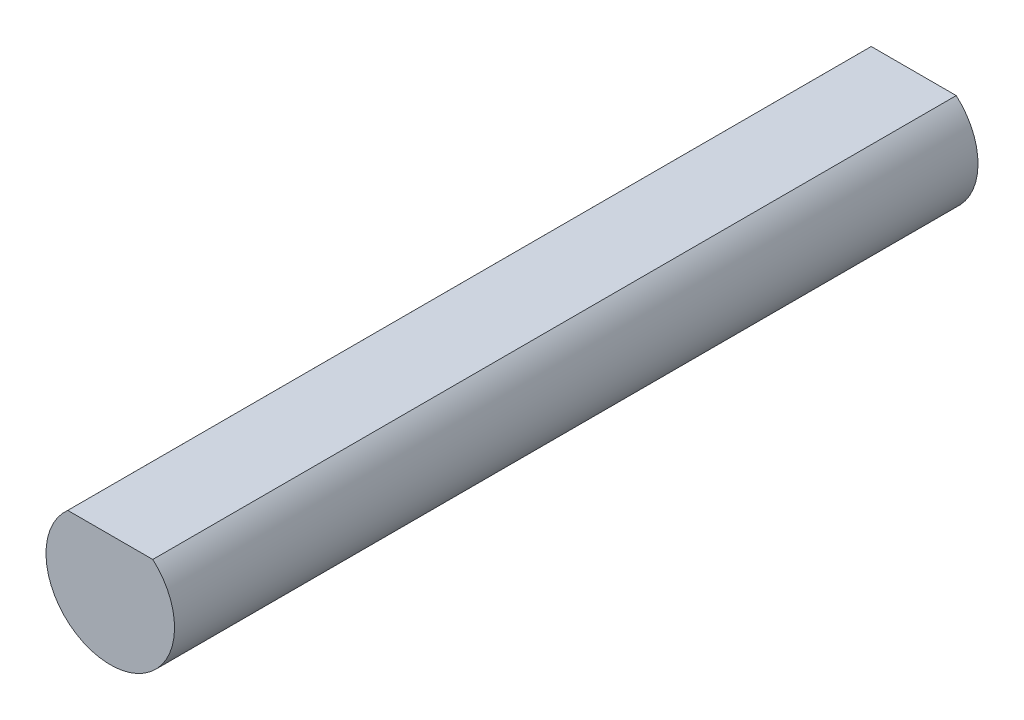
ISO-10303-21;
HEADER;
FILE_DESCRIPTION(('STEP AP214'),'2;1');
FILE_NAME('part.step','',(''),(''),'','','');
FILE_SCHEMA(('AUTOMOTIVE_DESIGN { 1 0 10303 214 1 1 1 1 }'));
ENDSEC;
DATA;
#1=APPLICATION_CONTEXT('core data for automotive mechanical design processes');
#2=APPLICATION_PROTOCOL_DEFINITION('international standard','automotive_design',2000,#1);
#3=PRODUCT_CONTEXT('',#1,'mechanical');
#4=PRODUCT('Part','Part','',(#3));
#5=PRODUCT_RELATED_PRODUCT_CATEGORY('part','',(#4));
#6=PRODUCT_DEFINITION_FORMATION('','',#4);
#7=PRODUCT_DEFINITION_CONTEXT('part definition',#1,'design');
#8=PRODUCT_DEFINITION('design','',#6,#7);
#9=PRODUCT_DEFINITION_SHAPE('','',#8);
#10=(LENGTH_UNIT() NAMED_UNIT(*) SI_UNIT(.MILLI.,.METRE.));
#11=(NAMED_UNIT(*) PLANE_ANGLE_UNIT() SI_UNIT($,.RADIAN.));
#12=(NAMED_UNIT(*) SI_UNIT($,.STERADIAN.) SOLID_ANGLE_UNIT());
#13=UNCERTAINTY_MEASURE_WITH_UNIT(LENGTH_MEASURE(1.E-05),#10,'distance_accuracy_value','');
#14=(GEOMETRIC_REPRESENTATION_CONTEXT(3) GLOBAL_UNCERTAINTY_ASSIGNED_CONTEXT((#13)) GLOBAL_UNIT_ASSIGNED_CONTEXT((#10,
#11,#12)) REPRESENTATION_CONTEXT('',''));
#15=CARTESIAN_POINT('',(0.,0.,0.));
#16=DIRECTION('',(0.,0.,1.));
#17=DIRECTION('',(1.,0.,0.));
#18=AXIS2_PLACEMENT_3D('',#15,#16,#17);
#19=CARTESIAN_POINT('',(0.,0.,25.));
#20=DIRECTION('',(0.,0.,-1.));
#21=DIRECTION('',(-1.,0.,0.));
#22=AXIS2_PLACEMENT_3D('',#19,#20,#21);
#23=CYLINDRICAL_SURFACE('',#22,2.);
#24=CARTESIAN_POINT('',(0.,0.,0.));
#25=DIRECTION('',(0.,0.,1.));
#26=DIRECTION('',(-1.,0.,0.));
#27=AXIS2_PLACEMENT_3D('',#24,#25,#26);
#28=CIRCLE('',#27,2.);
#29=CARTESIAN_POINT('',(-1.3228756555323,1.5,0.));
#30=VERTEX_POINT('',#29);
#31=CARTESIAN_POINT('',(1.3228756555323,1.5,0.));
#32=VERTEX_POINT('',#31);
#33=EDGE_CURVE('E72',#30,#32,#28,.T.);
#34=ORIENTED_EDGE('',*,*,#33,.T.);
#35=DIRECTION('',(0.,0.,-1.));
#36=VECTOR('',#35,1.);
#37=CARTESIAN_POINT('',(1.3228756555323,1.5,25.));
#38=LINE('',#37,#36);
#39=CARTESIAN_POINT('',(1.3228756555323,1.5,25.));
#40=VERTEX_POINT('',#39);
#41=EDGE_CURVE('E11',#40,#32,#38,.T.);
#42=ORIENTED_EDGE('',*,*,#41,.F.);
#43=CARTESIAN_POINT('',(0.,0.,25.));
#44=DIRECTION('',(0.,0.,1.));
#45=DIRECTION('',(-1.,0.,0.));
#46=AXIS2_PLACEMENT_3D('',#43,#44,#45);
#47=CIRCLE('',#46,2.);
#48=CARTESIAN_POINT('',(-1.3228756555323,1.5,25.));
#49=VERTEX_POINT('',#48);
#50=EDGE_CURVE('E71',#49,#40,#47,.T.);
#51=ORIENTED_EDGE('',*,*,#50,.F.);
#52=DIRECTION('',(0.,0.,-1.));
#53=VECTOR('',#52,1.);
#54=CARTESIAN_POINT('',(-1.3228756555323,1.5,25.));
#55=LINE('',#54,#53);
#56=EDGE_CURVE('E48',#49,#30,#55,.T.);
#57=ORIENTED_EDGE('',*,*,#56,.T.);
#58=EDGE_LOOP('',(#34,#42,#51,#57));
#59=FACE_BOUND('',#58,.T.);
#60=ADVANCED_FACE('F39',(#59),#23,.T.);
#61=CARTESIAN_POINT('',(-1.3228756555323,1.5,25.));
#62=DIRECTION('',(0.,-1.,0.));
#63=DIRECTION('',(0.,0.,-1.));
#64=AXIS2_PLACEMENT_3D('',#61,#62,#63);
#65=PLANE('',#64);
#66=DIRECTION('',(-1.,0.,0.));
#67=VECTOR('',#66,1.);
#68=CARTESIAN_POINT('',(-1.3228756555323,1.5,0.));
#69=LINE('',#68,#67);
#70=EDGE_CURVE('E63',#32,#30,#69,.T.);
#71=ORIENTED_EDGE('',*,*,#70,.T.);
#72=ORIENTED_EDGE('',*,*,#56,.F.);
#73=DIRECTION('',(-1.,0.,0.));
#74=VECTOR('',#73,1.);
#75=CARTESIAN_POINT('',(-1.3228756555323,1.5,25.));
#76=LINE('',#75,#74);
#77=EDGE_CURVE('E55',#40,#49,#76,.T.);
#78=ORIENTED_EDGE('',*,*,#77,.F.);
#79=ORIENTED_EDGE('',*,*,#41,.T.);
#80=EDGE_LOOP('',(#71,#72,#78,#79));
#81=FACE_BOUND('',#80,.T.);
#82=ADVANCED_FACE('F66',(#81),#65,.F.);
#83=CARTESIAN_POINT('',(0.,0.,25.));
#84=DIRECTION('',(0.,0.,-1.));
#85=DIRECTION('',(-1.,0.,0.));
#86=AXIS2_PLACEMENT_3D('',#83,#84,#85);
#87=PLANE('',#86);
#88=ORIENTED_EDGE('',*,*,#50,.T.);
#89=ORIENTED_EDGE('',*,*,#77,.T.);
#90=EDGE_LOOP('',(#88,#89));
#91=FACE_BOUND('',#90,.T.);
#92=ADVANCED_FACE('F83',(#91),#87,.F.);
#93=CARTESIAN_POINT('',(0.,0.,0.));
#94=DIRECTION('',(0.,0.,-1.));
#95=DIRECTION('',(-1.,0.,0.));
#96=AXIS2_PLACEMENT_3D('',#93,#94,#95);
#97=PLANE('',#96);
#98=ORIENTED_EDGE('',*,*,#33,.F.);
#99=ORIENTED_EDGE('',*,*,#70,.F.);
#100=EDGE_LOOP('',(#98,#99));
#101=FACE_BOUND('',#100,.T.);
#102=ADVANCED_FACE('F76',(#101),#97,.T.);
#103=CLOSED_SHELL('',(#60,#82,#92,#102));
#104=MANIFOLD_SOLID_BREP('B2',#103);
#105=ADVANCED_BREP_SHAPE_REPRESENTATION('',(#18,#104),#14);
#106=SHAPE_DEFINITION_REPRESENTATION(#9,#105);
ENDSEC;
END-ISO-10303-21;
